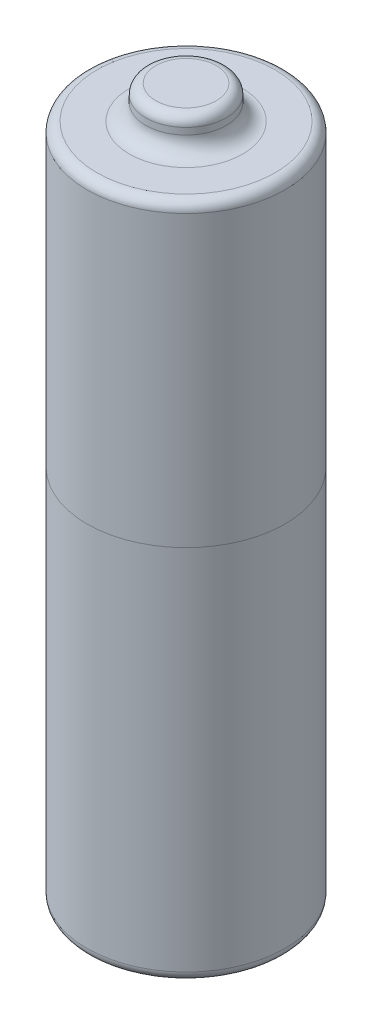
ISO-10303-21;
HEADER;
FILE_DESCRIPTION(('STEP AP214'),'2;1');
FILE_NAME('part.step','',(''),(''),'','','');
FILE_SCHEMA(('AUTOMOTIVE_DESIGN { 1 0 10303 214 1 1 1 1 }'));
ENDSEC;
DATA;
#1=APPLICATION_CONTEXT('core data for automotive mechanical design processes');
#2=APPLICATION_PROTOCOL_DEFINITION('international standard','automotive_design',2000,#1);
#3=PRODUCT_CONTEXT('',#1,'mechanical');
#4=PRODUCT('Part','Part','',(#3));
#5=PRODUCT_RELATED_PRODUCT_CATEGORY('part','',(#4));
#6=PRODUCT_DEFINITION_FORMATION('','',#4);
#7=PRODUCT_DEFINITION_CONTEXT('part definition',#1,'design');
#8=PRODUCT_DEFINITION('design','',#6,#7);
#9=PRODUCT_DEFINITION_SHAPE('','',#8);
#10=(LENGTH_UNIT() NAMED_UNIT(*) SI_UNIT(.MILLI.,.METRE.));
#11=(NAMED_UNIT(*) PLANE_ANGLE_UNIT() SI_UNIT($,.RADIAN.));
#12=(NAMED_UNIT(*) SI_UNIT($,.STERADIAN.) SOLID_ANGLE_UNIT());
#13=UNCERTAINTY_MEASURE_WITH_UNIT(LENGTH_MEASURE(1.E-05),#10,'distance_accuracy_value','');
#14=(GEOMETRIC_REPRESENTATION_CONTEXT(3) GLOBAL_UNCERTAINTY_ASSIGNED_CONTEXT((#13)) GLOBAL_UNIT_ASSIGNED_CONTEXT((#10,
#11,#12)) REPRESENTATION_CONTEXT('',''));
#15=CARTESIAN_POINT('',(0.,0.,0.));
#16=DIRECTION('',(0.,0.,1.));
#17=DIRECTION('',(1.,0.,0.));
#18=AXIS2_PLACEMENT_3D('',#15,#16,#17);
#19=CARTESIAN_POINT('',(-1.56983219052502,45.5858674704976,-12.7));
#20=DIRECTION('',(0.,-1.,0.));
#21=DIRECTION('',(0.,0.,-1.));
#22=AXIS2_PLACEMENT_3D('',#19,#20,#21);
#23=CYLINDRICAL_SURFACE('',#22,7.62);
#24=CARTESIAN_POINT('',(-1.56983219052502,-5.72213252950234,-12.7));
#25=DIRECTION('',(0.,1.,0.));
#26=DIRECTION('',(0.,0.,1.));
#27=AXIS2_PLACEMENT_3D('',#24,#25,#26);
#28=CIRCLE('',#27,7.62);
#29=CARTESIAN_POINT('',(-1.56983219052502,-5.72213252950234,-5.08));
#30=VERTEX_POINT('',#29);
#31=EDGE_CURVE('E62',#30,#30,#28,.T.);
#32=ORIENTED_EDGE('',*,*,#31,.T.);
#33=EDGE_LOOP('',(#32));
#34=FACE_BOUND('',#33,.T.);
#35=CARTESIAN_POINT('',(-1.56983219052502,22.5597789065362,-12.7));
#36=DIRECTION('',(0.,1.,0.));
#37=DIRECTION('',(0.,0.,1.));
#38=AXIS2_PLACEMENT_3D('',#35,#36,#37);
#39=CIRCLE('',#38,7.62);
#40=CARTESIAN_POINT('',(-1.56983219052502,22.5597789065362,-5.08));
#41=VERTEX_POINT('',#40);
#42=EDGE_CURVE('E79',#41,#41,#39,.T.);
#43=ORIENTED_EDGE('',*,*,#42,.F.);
#44=EDGE_LOOP('',(#43));
#45=FACE_BOUND('',#44,.T.);
#46=ADVANCED_FACE('F47',(#34,#45),#23,.T.);
#47=CARTESIAN_POINT('',(-1.56983219052502,-6.48413252950234,-12.7));
#48=DIRECTION('',(0.,1.,0.));
#49=DIRECTION('',(0.,0.,1.));
#50=AXIS2_PLACEMENT_3D('',#47,#48,#49);
#51=PLANE('',#50);
#52=CARTESIAN_POINT('',(-1.56983219052502,-6.48413252950234,-12.7));
#53=DIRECTION('',(0.,1.,0.));
#54=DIRECTION('',(0.,0.,1.));
#55=AXIS2_PLACEMENT_3D('',#52,#53,#54);
#56=CIRCLE('',#55,6.858);
#57=CARTESIAN_POINT('',(-1.56983219052502,-6.48413252950234,-5.842));
#58=VERTEX_POINT('',#57);
#59=EDGE_CURVE('E58',#58,#58,#56,.F.);
#60=ORIENTED_EDGE('',*,*,#59,.T.);
#61=EDGE_LOOP('',(#60));
#62=FACE_BOUND('',#61,.T.);
#63=CARTESIAN_POINT('',(-1.56983219052503,-6.48413252950234,-12.7));
#64=DIRECTION('',(0.,1.,0.));
#65=DIRECTION('',(0.,0.,1.));
#66=AXIS2_PLACEMENT_3D('',#63,#64,#65);
#67=CIRCLE('',#66,6.05891648957762);
#68=CARTESIAN_POINT('',(-1.56983219052503,-6.48413252950234,-6.64108351042238));
#69=VERTEX_POINT('',#68);
#70=EDGE_CURVE('E83',#69,#69,#67,.F.);
#71=ORIENTED_EDGE('',*,*,#70,.F.);
#72=EDGE_LOOP('',(#71));
#73=FACE_BOUND('',#72,.T.);
#74=ADVANCED_FACE('F99',(#62,#73),#51,.F.);
#75=CARTESIAN_POINT('',(-1.56983219052502,45.5858674704976,-12.7));
#76=DIRECTION('',(0.,1.,0.));
#77=DIRECTION('',(0.,0.,1.));
#78=AXIS2_PLACEMENT_3D('',#75,#76,#77);
#79=PLANE('',#78);
#80=CARTESIAN_POINT('',(-1.56983219052502,45.5858674704976,-12.7));
#81=DIRECTION('',(0.,1.,0.));
#82=DIRECTION('',(0.,0.,1.));
#83=AXIS2_PLACEMENT_3D('',#80,#81,#82);
#84=CIRCLE('',#83,6.858);
#85=CARTESIAN_POINT('',(-1.56983219052502,45.5858674704976,-5.842));
#86=VERTEX_POINT('',#85);
#87=EDGE_CURVE('E70',#86,#86,#84,.T.);
#88=ORIENTED_EDGE('',*,*,#87,.T.);
#89=EDGE_LOOP('',(#88));
#90=FACE_BOUND('',#89,.T.);
#91=CARTESIAN_POINT('',(-1.56983219052503,45.5858674704976,-12.7));
#92=DIRECTION('',(0.,1.,0.));
#93=DIRECTION('',(0.,0.,1.));
#94=AXIS2_PLACEMENT_3D('',#91,#92,#93);
#95=CIRCLE('',#94,4.36514570682741);
#96=CARTESIAN_POINT('',(-1.56983219052503,45.5858674704976,-8.33485429317259));
#97=VERTEX_POINT('',#96);
#98=EDGE_CURVE('E73',#97,#97,#95,.F.);
#99=ORIENTED_EDGE('',*,*,#98,.T.);
#100=EDGE_LOOP('',(#99));
#101=FACE_BOUND('',#100,.T.);
#102=ADVANCED_FACE('F101',(#90,#101),#79,.T.);
#103=CARTESIAN_POINT('',(-1.56983219052502,44.8238674704977,-12.7));
#104=DIRECTION('',(0.,1.,0.));
#105=DIRECTION('',(0.,0.,1.));
#106=AXIS2_PLACEMENT_3D('',#103,#104,#105);
#107=CIRCLE('',#106,7.62);
#108=CARTESIAN_POINT('',(-1.56983219052502,44.8238674704977,-5.08));
#109=VERTEX_POINT('',#108);
#110=EDGE_CURVE('E67',#109,#109,#107,.F.);
#111=ORIENTED_EDGE('',*,*,#110,.T.);
#112=EDGE_LOOP('',(#111));
#113=FACE_BOUND('',#112,.T.);
#114=ORIENTED_EDGE('',*,*,#42,.T.);
#115=EDGE_LOOP('',(#114));
#116=FACE_BOUND('',#115,.T.);
#117=ADVANCED_FACE('F108',(#113,#116),#23,.T.);
#118=CARTESIAN_POINT('',(-1.56983219052503,48.1258674704977,-12.7));
#119=DIRECTION('',(0.,-1.,0.));
#120=DIRECTION('',(0.,0.,-1.));
#121=AXIS2_PLACEMENT_3D('',#118,#119,#120);
#122=CYLINDRICAL_SURFACE('',#121,3.09514570682741);
#123=CARTESIAN_POINT('',(-1.56983219052503,47.3638674704977,-12.7));
#124=DIRECTION('',(0.,1.,0.));
#125=DIRECTION('',(0.,0.,1.));
#126=AXIS2_PLACEMENT_3D('',#123,#124,#125);
#127=CIRCLE('',#126,3.09514570682741);
#128=CARTESIAN_POINT('',(-1.56983219052503,47.3638674704977,-9.60485429317259));
#129=VERTEX_POINT('',#128);
#130=EDGE_CURVE('E10',#129,#129,#127,.F.);
#131=ORIENTED_EDGE('',*,*,#130,.T.);
#132=EDGE_LOOP('',(#131));
#133=FACE_BOUND('',#132,.T.);
#134=CARTESIAN_POINT('',(-1.56983219052503,46.8558674704976,-12.7));
#135=DIRECTION('',(0.,1.,0.));
#136=DIRECTION('',(0.,0.,1.));
#137=AXIS2_PLACEMENT_3D('',#134,#135,#136);
#138=CIRCLE('',#137,3.09514570682741);
#139=CARTESIAN_POINT('',(-1.56983219052503,46.8558674704976,-9.60485429317259));
#140=VERTEX_POINT('',#139);
#141=EDGE_CURVE('E76',#140,#140,#138,.T.);
#142=ORIENTED_EDGE('',*,*,#141,.T.);
#143=EDGE_LOOP('',(#142));
#144=FACE_BOUND('',#143,.T.);
#145=ADVANCED_FACE('F114',(#133,#144),#122,.T.);
#146=CARTESIAN_POINT('',(-1.56983219052503,48.1258674704977,-12.7));
#147=DIRECTION('',(0.,1.,0.));
#148=DIRECTION('',(0.,0.,1.));
#149=AXIS2_PLACEMENT_3D('',#146,#147,#148);
#150=PLANE('',#149);
#151=CARTESIAN_POINT('',(-1.56983219052503,48.1258674704977,-12.7));
#152=DIRECTION('',(0.,1.,0.));
#153=DIRECTION('',(0.,0.,1.));
#154=AXIS2_PLACEMENT_3D('',#151,#152,#153);
#155=CIRCLE('',#154,2.33314570682741);
#156=CARTESIAN_POINT('',(-1.56983219052503,48.1258674704977,-10.3668542931726));
#157=VERTEX_POINT('',#156);
#158=EDGE_CURVE('E54',#157,#157,#155,.T.);
#159=ORIENTED_EDGE('',*,*,#158,.T.);
#160=EDGE_LOOP('',(#159));
#161=FACE_BOUND('',#160,.T.);
#162=ADVANCED_FACE('F95',(#161),#150,.T.);
#163=CARTESIAN_POINT('',(-1.56983219052503,-6.73813252950234,-12.7));
#164=DIRECTION('',(0.,1.,0.));
#165=DIRECTION('',(0.,0.,1.));
#166=AXIS2_PLACEMENT_3D('',#163,#164,#165);
#167=CYLINDRICAL_SURFACE('',#166,6.05891648957762);
#168=CARTESIAN_POINT('',(-1.56983219052503,-6.73813252950234,-12.7));
#169=DIRECTION('',(0.,-1.,0.));
#170=DIRECTION('',(0.,0.,-1.));
#171=AXIS2_PLACEMENT_3D('',#168,#169,#170);
#172=CIRCLE('',#171,6.05891648957762);
#173=CARTESIAN_POINT('',(-1.56983219052503,-6.73813252950234,-18.7589164895776));
#174=VERTEX_POINT('',#173);
#175=EDGE_CURVE('E86',#174,#174,#172,.T.);
#176=ORIENTED_EDGE('',*,*,#175,.F.);
#177=EDGE_LOOP('',(#176));
#178=FACE_BOUND('',#177,.T.);
#179=ORIENTED_EDGE('',*,*,#70,.T.);
#180=EDGE_LOOP('',(#179));
#181=FACE_BOUND('',#180,.T.);
#182=ADVANCED_FACE('F92',(#178,#181),#167,.T.);
#183=CARTESIAN_POINT('',(-1.56983219052503,-6.73813252950234,-12.7));
#184=DIRECTION('',(0.,-1.,0.));
#185=DIRECTION('',(0.,0.,-1.));
#186=AXIS2_PLACEMENT_3D('',#183,#184,#185);
#187=PLANE('',#186);
#188=ORIENTED_EDGE('',*,*,#175,.T.);
#189=EDGE_LOOP('',(#188));
#190=FACE_BOUND('',#189,.T.);
#191=ADVANCED_FACE('F90',(#190),#187,.T.);
#192=CARTESIAN_POINT('',(-1.56983219052503,46.8558674704976,-12.7));
#193=DIRECTION('',(0.,1.,0.));
#194=DIRECTION('',(0.,0.,1.));
#195=AXIS2_PLACEMENT_3D('',#192,#193,#194);
#196=TOROIDAL_SURFACE('',#195,4.36514570682741,1.27);
#197=ORIENTED_EDGE('',*,*,#98,.F.);
#198=EDGE_LOOP('',(#197));
#199=FACE_BOUND('',#198,.T.);
#200=ORIENTED_EDGE('',*,*,#141,.F.);
#201=EDGE_LOOP('',(#200));
#202=FACE_BOUND('',#201,.T.);
#203=ADVANCED_FACE('F119',(#199,#202),#196,.F.);
#204=CARTESIAN_POINT('',(-1.56983219052502,44.8238674704977,-12.7));
#205=DIRECTION('',(0.,1.,0.));
#206=DIRECTION('',(0.,0.,1.));
#207=AXIS2_PLACEMENT_3D('',#204,#205,#206);
#208=TOROIDAL_SURFACE('',#207,6.858,0.762);
#209=ORIENTED_EDGE('',*,*,#110,.F.);
#210=EDGE_LOOP('',(#209));
#211=FACE_BOUND('',#210,.T.);
#212=ORIENTED_EDGE('',*,*,#87,.F.);
#213=EDGE_LOOP('',(#212));
#214=FACE_BOUND('',#213,.T.);
#215=ADVANCED_FACE('F122',(#211,#214),#208,.T.);
#216=CARTESIAN_POINT('',(-1.56983219052502,-5.72213252950234,-12.7));
#217=DIRECTION('',(0.,1.,0.));
#218=DIRECTION('',(0.,0.,1.));
#219=AXIS2_PLACEMENT_3D('',#216,#217,#218);
#220=TOROIDAL_SURFACE('',#219,6.858,0.762);
#221=ORIENTED_EDGE('',*,*,#59,.F.);
#222=EDGE_LOOP('',(#221));
#223=FACE_BOUND('',#222,.T.);
#224=ORIENTED_EDGE('',*,*,#31,.F.);
#225=EDGE_LOOP('',(#224));
#226=FACE_BOUND('',#225,.T.);
#227=ADVANCED_FACE('F125',(#223,#226),#220,.T.);
#228=CARTESIAN_POINT('',(-1.56983219052503,47.3638674704977,-12.7));
#229=DIRECTION('',(0.,1.,0.));
#230=DIRECTION('',(0.,0.,1.));
#231=AXIS2_PLACEMENT_3D('',#228,#229,#230);
#232=TOROIDAL_SURFACE('',#231,2.33314570682741,0.762);
#233=ORIENTED_EDGE('',*,*,#130,.F.);
#234=EDGE_LOOP('',(#233));
#235=FACE_BOUND('',#234,.T.);
#236=ORIENTED_EDGE('',*,*,#158,.F.);
#237=EDGE_LOOP('',(#236));
#238=FACE_BOUND('',#237,.T.);
#239=ADVANCED_FACE('F49',(#235,#238),#232,.T.);
#240=CLOSED_SHELL('',(#46,#74,#102,#117,#145,#162,#182,#191,#203,#215,#227,#239));
#241=MANIFOLD_SOLID_BREP('B2',#240);
#242=ADVANCED_BREP_SHAPE_REPRESENTATION('',(#18,#241),#14);
#243=SHAPE_DEFINITION_REPRESENTATION(#9,#242);
ENDSEC;
END-ISO-10303-21;
